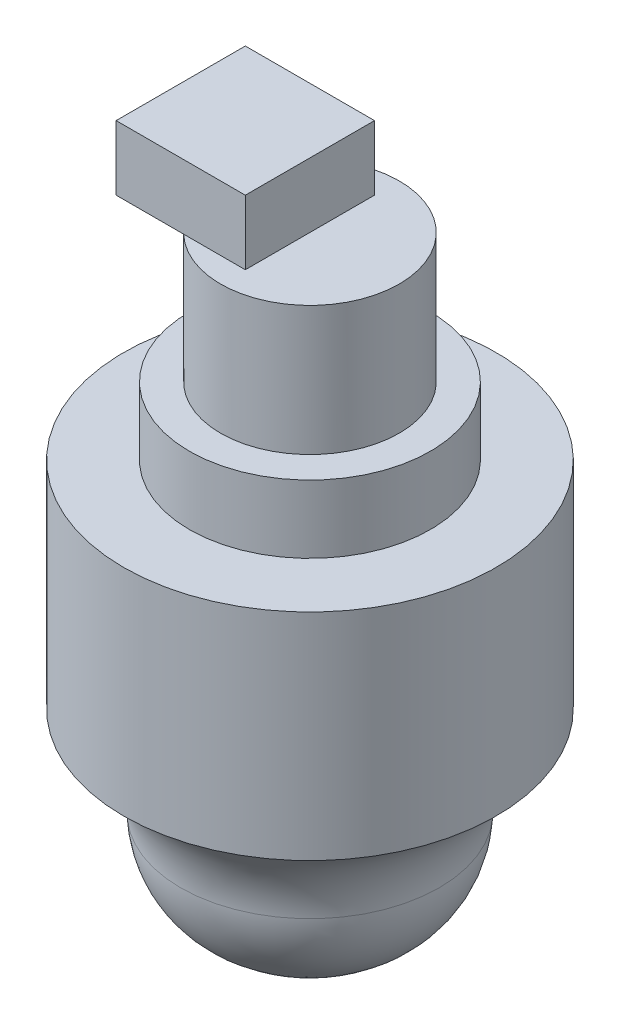
ISO-10303-21;
HEADER;
FILE_DESCRIPTION(('STEP AP214'),'2;1');
FILE_NAME('part.step','',(''),(''),'','','');
FILE_SCHEMA(('AUTOMOTIVE_DESIGN { 1 0 10303 214 1 1 1 1 }'));
ENDSEC;
DATA;
#1=APPLICATION_CONTEXT('core data for automotive mechanical design processes');
#2=APPLICATION_PROTOCOL_DEFINITION('international standard','automotive_design',2000,#1);
#3=PRODUCT_CONTEXT('',#1,'mechanical');
#4=PRODUCT('Part','Part','',(#3));
#5=PRODUCT_RELATED_PRODUCT_CATEGORY('part','',(#4));
#6=PRODUCT_DEFINITION_FORMATION('','',#4);
#7=PRODUCT_DEFINITION_CONTEXT('part definition',#1,'design');
#8=PRODUCT_DEFINITION('design','',#6,#7);
#9=PRODUCT_DEFINITION_SHAPE('','',#8);
#10=(LENGTH_UNIT() NAMED_UNIT(*) SI_UNIT(.MILLI.,.METRE.));
#11=(NAMED_UNIT(*) PLANE_ANGLE_UNIT() SI_UNIT($,.RADIAN.));
#12=(NAMED_UNIT(*) SI_UNIT($,.STERADIAN.) SOLID_ANGLE_UNIT());
#13=UNCERTAINTY_MEASURE_WITH_UNIT(LENGTH_MEASURE(1.E-05),#10,'distance_accuracy_value','');
#14=(GEOMETRIC_REPRESENTATION_CONTEXT(3) GLOBAL_UNCERTAINTY_ASSIGNED_CONTEXT((#13)) GLOBAL_UNIT_ASSIGNED_CONTEXT((#10,
#11,#12)) REPRESENTATION_CONTEXT('',''));
#15=CARTESIAN_POINT('',(0.,0.,0.));
#16=DIRECTION('',(0.,0.,1.));
#17=DIRECTION('',(1.,0.,0.));
#18=AXIS2_PLACEMENT_3D('',#15,#16,#17);
#19=CARTESIAN_POINT('',(0.,48.641,0.));
#20=DIRECTION('',(0.,1.,0.));
#21=DIRECTION('',(0.,0.,1.));
#22=AXIS2_PLACEMENT_3D('',#19,#20,#21);
#23=PLANE('',#22);
#24=DIRECTION('',(0.,0.,-1.));
#25=VECTOR('',#24,1.);
#26=CARTESIAN_POINT('',(0.,48.641,0.));
#27=LINE('',#26,#25);
#28=CARTESIAN_POINT('',(0.,48.641,7.62));
#29=VERTEX_POINT('',#28);
#30=CARTESIAN_POINT('',(0.,48.641,-7.62));
#31=VERTEX_POINT('',#30);
#32=EDGE_CURVE('E52',#29,#31,#27,.T.);
#33=ORIENTED_EDGE('',*,*,#32,.F.);
#34=DIRECTION('',(-1.,0.,0.));
#35=VECTOR('',#34,1.);
#36=CARTESIAN_POINT('',(0.,48.641,7.62));
#37=LINE('',#36,#35);
#38=CARTESIAN_POINT('',(-7.28342508714135,48.641,7.62));
#39=VERTEX_POINT('',#38);
#40=EDGE_CURVE('E57',#29,#39,#37,.T.);
#41=ORIENTED_EDGE('',*,*,#40,.T.);
#42=CARTESIAN_POINT('',(0.,48.641,0.));
#43=DIRECTION('',(0.,1.,0.));
#44=DIRECTION('',(0.,0.,1.));
#45=AXIS2_PLACEMENT_3D('',#42,#43,#44);
#46=CIRCLE('',#45,10.541);
#47=CARTESIAN_POINT('',(-7.28342508714136,48.641,-7.62));
#48=VERTEX_POINT('',#47);
#49=EDGE_CURVE('E130',#39,#48,#46,.T.);
#50=ORIENTED_EDGE('',*,*,#49,.T.);
#51=DIRECTION('',(-1.,0.,0.));
#52=VECTOR('',#51,1.);
#53=CARTESIAN_POINT('',(0.,48.641,-7.62));
#54=LINE('',#53,#52);
#55=EDGE_CURVE('E117',#31,#48,#54,.T.);
#56=ORIENTED_EDGE('',*,*,#55,.F.);
#57=EDGE_LOOP('',(#33,#41,#50,#56));
#58=FACE_BOUND('',#57,.T.);
#59=ADVANCED_FACE('F37',(#58),#23,.T.);
#60=CARTESIAN_POINT('',(0.,33.401,0.));
#61=DIRECTION('',(0.,1.,0.));
#62=DIRECTION('',(0.,0.,1.));
#63=AXIS2_PLACEMENT_3D('',#60,#61,#62);
#64=PLANE('',#63);
#65=CARTESIAN_POINT('',(0.,33.401,0.));
#66=DIRECTION('',(0.,1.,0.));
#67=DIRECTION('',(0.,0.,1.));
#68=AXIS2_PLACEMENT_3D('',#65,#66,#67);
#69=CIRCLE('',#68,14.224);
#70=CARTESIAN_POINT('',(0.,33.401,14.224));
#71=VERTEX_POINT('',#70);
#72=EDGE_CURVE('E133',#71,#71,#69,.T.);
#73=ORIENTED_EDGE('',*,*,#72,.T.);
#74=EDGE_LOOP('',(#73));
#75=FACE_BOUND('',#74,.T.);
#76=CARTESIAN_POINT('',(0.,33.401,0.));
#77=DIRECTION('',(0.,1.,0.));
#78=DIRECTION('',(0.,0.,1.));
#79=AXIS2_PLACEMENT_3D('',#76,#77,#78);
#80=CIRCLE('',#79,10.541);
#81=CARTESIAN_POINT('',(0.,33.401,10.541));
#82=VERTEX_POINT('',#81);
#83=EDGE_CURVE('E103',#82,#82,#80,.T.);
#84=ORIENTED_EDGE('',*,*,#83,.F.);
#85=EDGE_LOOP('',(#84));
#86=FACE_BOUND('',#85,.T.);
#87=ADVANCED_FACE('F157',(#75,#86),#64,.T.);
#88=CARTESIAN_POINT('',(0.,25.4,0.));
#89=DIRECTION('',(0.,1.,0.));
#90=DIRECTION('',(0.,0.,1.));
#91=AXIS2_PLACEMENT_3D('',#88,#89,#90);
#92=PLANE('',#91);
#93=CARTESIAN_POINT('',(0.,25.4,0.));
#94=DIRECTION('',(0.,1.,0.));
#95=DIRECTION('',(0.,0.,1.));
#96=AXIS2_PLACEMENT_3D('',#93,#94,#95);
#97=CIRCLE('',#96,21.971);
#98=CARTESIAN_POINT('',(0.,25.4,21.971));
#99=VERTEX_POINT('',#98);
#100=EDGE_CURVE('E139',#99,#99,#97,.T.);
#101=ORIENTED_EDGE('',*,*,#100,.T.);
#102=EDGE_LOOP('',(#101));
#103=FACE_BOUND('',#102,.T.);
#104=CARTESIAN_POINT('',(0.,25.4,0.));
#105=DIRECTION('',(0.,1.,0.));
#106=DIRECTION('',(0.,0.,1.));
#107=AXIS2_PLACEMENT_3D('',#104,#105,#106);
#108=CIRCLE('',#107,14.224);
#109=CARTESIAN_POINT('',(0.,25.4,14.224));
#110=VERTEX_POINT('',#109);
#111=EDGE_CURVE('E129',#110,#110,#108,.T.);
#112=ORIENTED_EDGE('',*,*,#111,.F.);
#113=EDGE_LOOP('',(#112));
#114=FACE_BOUND('',#113,.T.);
#115=ADVANCED_FACE('F162',(#103,#114),#92,.T.);
#116=CARTESIAN_POINT('',(0.,25.4,0.));
#117=DIRECTION('',(0.,-1.,0.));
#118=DIRECTION('',(0.,0.,-1.));
#119=AXIS2_PLACEMENT_3D('',#116,#117,#118);
#120=CYLINDRICAL_SURFACE('',#119,21.971);
#121=ORIENTED_EDGE('',*,*,#100,.F.);
#122=EDGE_LOOP('',(#121));
#123=FACE_BOUND('',#122,.T.);
#124=CARTESIAN_POINT('',(0.,0.,0.));
#125=DIRECTION('',(0.,1.,0.));
#126=DIRECTION('',(0.,0.,1.));
#127=AXIS2_PLACEMENT_3D('',#124,#125,#126);
#128=CIRCLE('',#127,21.971);
#129=CARTESIAN_POINT('',(0.,0.,21.971));
#130=VERTEX_POINT('',#129);
#131=EDGE_CURVE('E136',#130,#130,#128,.T.);
#132=ORIENTED_EDGE('',*,*,#131,.T.);
#133=EDGE_LOOP('',(#132));
#134=FACE_BOUND('',#133,.T.);
#135=ADVANCED_FACE('F175',(#123,#134),#120,.T.);
#136=CARTESIAN_POINT('',(0.,33.401,0.));
#137=DIRECTION('',(0.,-1.,0.));
#138=DIRECTION('',(0.,0.,-1.));
#139=AXIS2_PLACEMENT_3D('',#136,#137,#138);
#140=CYLINDRICAL_SURFACE('',#139,14.224);
#141=ORIENTED_EDGE('',*,*,#72,.F.);
#142=EDGE_LOOP('',(#141));
#143=FACE_BOUND('',#142,.T.);
#144=ORIENTED_EDGE('',*,*,#111,.T.);
#145=EDGE_LOOP('',(#144));
#146=FACE_BOUND('',#145,.T.);
#147=ADVANCED_FACE('F170',(#143,#146),#140,.T.);
#148=CARTESIAN_POINT('',(0.,48.641,0.));
#149=DIRECTION('',(0.,-1.,0.));
#150=DIRECTION('',(0.,0.,-1.));
#151=AXIS2_PLACEMENT_3D('',#148,#149,#150);
#152=CYLINDRICAL_SURFACE('',#151,10.541);
#153=EDGE_CURVE('E126',#48,#39,#46,.T.);
#154=ORIENTED_EDGE('',*,*,#153,.F.);
#155=ORIENTED_EDGE('',*,*,#49,.F.);
#156=EDGE_LOOP('',(#154,#155));
#157=FACE_BOUND('',#156,.T.);
#158=ORIENTED_EDGE('',*,*,#83,.T.);
#159=EDGE_LOOP('',(#158));
#160=FACE_BOUND('',#159,.T.);
#161=ADVANCED_FACE('F168',(#157,#160),#152,.T.);
#162=CARTESIAN_POINT('',(0.,56.261,7.62));
#163=DIRECTION('',(0.,0.,1.));
#164=DIRECTION('',(1.,0.,0.));
#165=AXIS2_PLACEMENT_3D('',#162,#163,#164);
#166=PLANE('',#165);
#167=ORIENTED_EDGE('',*,*,#40,.F.);
#168=DIRECTION('',(0.,-1.,0.));
#169=VECTOR('',#168,1.);
#170=CARTESIAN_POINT('',(0.,56.261,7.62));
#171=LINE('',#170,#169);
#172=CARTESIAN_POINT('',(0.,56.261,7.62));
#173=VERTEX_POINT('',#172);
#174=EDGE_CURVE('E104',#173,#29,#171,.T.);
#175=ORIENTED_EDGE('',*,*,#174,.F.);
#176=DIRECTION('',(-1.,0.,0.));
#177=VECTOR('',#176,1.);
#178=CARTESIAN_POINT('',(0.,56.261,7.62));
#179=LINE('',#178,#177);
#180=CARTESIAN_POINT('',(-15.24,56.261,7.62));
#181=VERTEX_POINT('',#180);
#182=EDGE_CURVE('E87',#173,#181,#179,.T.);
#183=ORIENTED_EDGE('',*,*,#182,.T.);
#184=DIRECTION('',(0.,-1.,0.));
#185=VECTOR('',#184,1.);
#186=CARTESIAN_POINT('',(-15.24,56.261,7.62));
#187=LINE('',#186,#185);
#188=CARTESIAN_POINT('',(-15.24,48.641,7.62));
#189=VERTEX_POINT('',#188);
#190=EDGE_CURVE('E98',#181,#189,#187,.T.);
#191=ORIENTED_EDGE('',*,*,#190,.T.);
#192=EDGE_CURVE('E114',#39,#189,#37,.T.);
#193=ORIENTED_EDGE('',*,*,#192,.F.);
#194=EDGE_LOOP('',(#167,#175,#183,#191,#193));
#195=FACE_BOUND('',#194,.T.);
#196=ADVANCED_FACE('F106',(#195),#166,.T.);
#197=CARTESIAN_POINT('',(0.,56.261,0.));
#198=DIRECTION('',(-1.,0.,0.));
#199=DIRECTION('',(0.,0.,1.));
#200=AXIS2_PLACEMENT_3D('',#197,#198,#199);
#201=PLANE('',#200);
#202=ORIENTED_EDGE('',*,*,#32,.T.);
#203=DIRECTION('',(0.,-1.,0.));
#204=VECTOR('',#203,1.);
#205=CARTESIAN_POINT('',(0.,56.261,-7.62));
#206=LINE('',#205,#204);
#207=CARTESIAN_POINT('',(0.,56.261,-7.62));
#208=VERTEX_POINT('',#207);
#209=EDGE_CURVE('E122',#208,#31,#206,.T.);
#210=ORIENTED_EDGE('',*,*,#209,.F.);
#211=DIRECTION('',(0.,0.,1.));
#212=VECTOR('',#211,1.);
#213=CARTESIAN_POINT('',(0.,56.261,0.));
#214=LINE('',#213,#212);
#215=EDGE_CURVE('E107',#208,#173,#214,.T.);
#216=ORIENTED_EDGE('',*,*,#215,.T.);
#217=ORIENTED_EDGE('',*,*,#174,.T.);
#218=EDGE_LOOP('',(#202,#210,#216,#217));
#219=FACE_BOUND('',#218,.T.);
#220=ADVANCED_FACE('F209',(#219),#201,.F.);
#221=CARTESIAN_POINT('',(0.,56.261,-7.62));
#222=DIRECTION('',(0.,0.,1.));
#223=DIRECTION('',(1.,0.,0.));
#224=AXIS2_PLACEMENT_3D('',#221,#222,#223);
#225=PLANE('',#224);
#226=ORIENTED_EDGE('',*,*,#55,.T.);
#227=CARTESIAN_POINT('',(-15.24,48.641,-7.62));
#228=VERTEX_POINT('',#227);
#229=EDGE_CURVE('E116',#48,#228,#54,.T.);
#230=ORIENTED_EDGE('',*,*,#229,.T.);
#231=DIRECTION('',(0.,-1.,0.));
#232=VECTOR('',#231,1.);
#233=CARTESIAN_POINT('',(-15.24,56.261,-7.62));
#234=LINE('',#233,#232);
#235=CARTESIAN_POINT('',(-15.24,56.261,-7.62));
#236=VERTEX_POINT('',#235);
#237=EDGE_CURVE('E112',#236,#228,#234,.T.);
#238=ORIENTED_EDGE('',*,*,#237,.F.);
#239=DIRECTION('',(-1.,0.,0.));
#240=VECTOR('',#239,1.);
#241=CARTESIAN_POINT('',(0.,56.261,-7.62));
#242=LINE('',#241,#240);
#243=EDGE_CURVE('E90',#208,#236,#242,.T.);
#244=ORIENTED_EDGE('',*,*,#243,.F.);
#245=ORIENTED_EDGE('',*,*,#209,.T.);
#246=EDGE_LOOP('',(#226,#230,#238,#244,#245));
#247=FACE_BOUND('',#246,.T.);
#248=ADVANCED_FACE('F215',(#247),#225,.F.);
#249=CARTESIAN_POINT('',(-15.24,56.261,0.));
#250=DIRECTION('',(-1.,0.,0.));
#251=DIRECTION('',(0.,0.,1.));
#252=AXIS2_PLACEMENT_3D('',#249,#250,#251);
#253=PLANE('',#252);
#254=DIRECTION('',(0.,0.,-1.));
#255=VECTOR('',#254,1.);
#256=CARTESIAN_POINT('',(-15.24,48.641,0.));
#257=LINE('',#256,#255);
#258=EDGE_CURVE('E94',#189,#228,#257,.T.);
#259=ORIENTED_EDGE('',*,*,#258,.F.);
#260=ORIENTED_EDGE('',*,*,#190,.F.);
#261=DIRECTION('',(0.,0.,1.));
#262=VECTOR('',#261,1.);
#263=CARTESIAN_POINT('',(-15.24,56.261,0.));
#264=LINE('',#263,#262);
#265=EDGE_CURVE('E83',#236,#181,#264,.T.);
#266=ORIENTED_EDGE('',*,*,#265,.F.);
#267=ORIENTED_EDGE('',*,*,#237,.T.);
#268=EDGE_LOOP('',(#259,#260,#266,#267));
#269=FACE_BOUND('',#268,.T.);
#270=ADVANCED_FACE('F99',(#269),#253,.T.);
#271=CARTESIAN_POINT('',(0.,56.261,0.));
#272=DIRECTION('',(0.,-1.,0.));
#273=DIRECTION('',(0.,0.,-1.));
#274=AXIS2_PLACEMENT_3D('',#271,#272,#273);
#275=PLANE('',#274);
#276=ORIENTED_EDGE('',*,*,#265,.T.);
#277=ORIENTED_EDGE('',*,*,#182,.F.);
#278=ORIENTED_EDGE('',*,*,#215,.F.);
#279=ORIENTED_EDGE('',*,*,#243,.T.);
#280=EDGE_LOOP('',(#276,#277,#278,#279));
#281=FACE_BOUND('',#280,.T.);
#282=ADVANCED_FACE('F85',(#281),#275,.F.);
#283=CARTESIAN_POINT('',(0.,48.641,0.));
#284=DIRECTION('',(0.,-1.,0.));
#285=DIRECTION('',(0.,0.,-1.));
#286=AXIS2_PLACEMENT_3D('',#283,#284,#285);
#287=PLANE('',#286);
#288=ORIENTED_EDGE('',*,*,#229,.F.);
#289=ORIENTED_EDGE('',*,*,#153,.T.);
#290=ORIENTED_EDGE('',*,*,#192,.T.);
#291=ORIENTED_EDGE('',*,*,#258,.T.);
#292=EDGE_LOOP('',(#288,#289,#290,#291));
#293=FACE_BOUND('',#292,.T.);
#294=ADVANCED_FACE('F235',(#293),#287,.T.);
#295=CARTESIAN_POINT('',(0.,-22.86,0.));
#296=DIRECTION('',(0.,-1.,0.));
#297=DIRECTION('',(0.,0.,-1.));
#298=AXIS2_PLACEMENT_3D('',#295,#296,#297);
#299=PLANE('',#298);
#300=CARTESIAN_POINT('',(0.,-22.86,0.));
#301=DIRECTION('',(0.,-1.,0.));
#302=DIRECTION('',(0.,0.,-1.));
#303=AXIS2_PLACEMENT_3D('',#300,#301,#302);
#304=CIRCLE('',#303,2.56170638723198);
#305=CARTESIAN_POINT('',(0.,-22.86,-2.56170638723198));
#306=VERTEX_POINT('',#305);
#307=EDGE_CURVE('E45',#306,#306,#304,.T.);
#308=ORIENTED_EDGE('',*,*,#307,.T.);
#309=EDGE_LOOP('',(#308));
#310=FACE_BOUND('',#309,.T.);
#311=ADVANCED_FACE('F146',(#310),#299,.T.);
#312=CARTESIAN_POINT('',(0.,-11.2098634692845,0.));
#313=DIRECTION('',(0.,1.,0.));
#314=DIRECTION('',(0.,0.,1.));
#315=AXIS2_PLACEMENT_3D('',#312,#313,#314);
#316=TOROIDAL_SURFACE('',#315,27.94,12.7);
#317=CARTESIAN_POINT('',(0.,-10.6849317346423,0.));
#318=DIRECTION('',(0.,-1.,0.));
#319=DIRECTION('',(0.,0.,-1.));
#320=AXIS2_PLACEMENT_3D('',#317,#318,#319);
#321=CIRCLE('',#320,15.250853193616);
#322=CARTESIAN_POINT('',(0.,-10.6849317346423,-15.250853193616));
#323=VERTEX_POINT('',#322);
#324=EDGE_CURVE('E11',#323,#323,#321,.F.);
#325=ORIENTED_EDGE('',*,*,#324,.T.);
#326=EDGE_LOOP('',(#325));
#327=FACE_BOUND('',#326,.T.);
#328=ORIENTED_EDGE('',*,*,#131,.F.);
#329=EDGE_LOOP('',(#328));
#330=FACE_BOUND('',#329,.T.);
#331=ADVANCED_FACE('F149',(#327,#330),#316,.F.);
#332=CARTESIAN_POINT('',(0.,-10.16,0.));
#333=DIRECTION('',(0.,1.,0.));
#334=DIRECTION('',(0.,0.,1.));
#335=AXIS2_PLACEMENT_3D('',#332,#333,#334);
#336=DEGENERATE_TOROIDAL_SURFACE('',#335,2.56170638723198,12.7,.T.);
#337=ORIENTED_EDGE('',*,*,#324,.F.);
#338=EDGE_LOOP('',(#337));
#339=FACE_BOUND('',#338,.T.);
#340=ORIENTED_EDGE('',*,*,#307,.F.);
#341=EDGE_LOOP('',(#340));
#342=FACE_BOUND('',#341,.T.);
#343=ADVANCED_FACE('F39',(#339,#342),#336,.T.);
#344=CLOSED_SHELL('',(#59,#87,#115,#135,#147,#161,#196,#220,#248,#270,#282,#294,#311,#331,#343));
#345=MANIFOLD_SOLID_BREP('B2',#344);
#346=ADVANCED_BREP_SHAPE_REPRESENTATION('',(#18,#345),#14);
#347=SHAPE_DEFINITION_REPRESENTATION(#9,#346);
ENDSEC;
END-ISO-10303-21;
